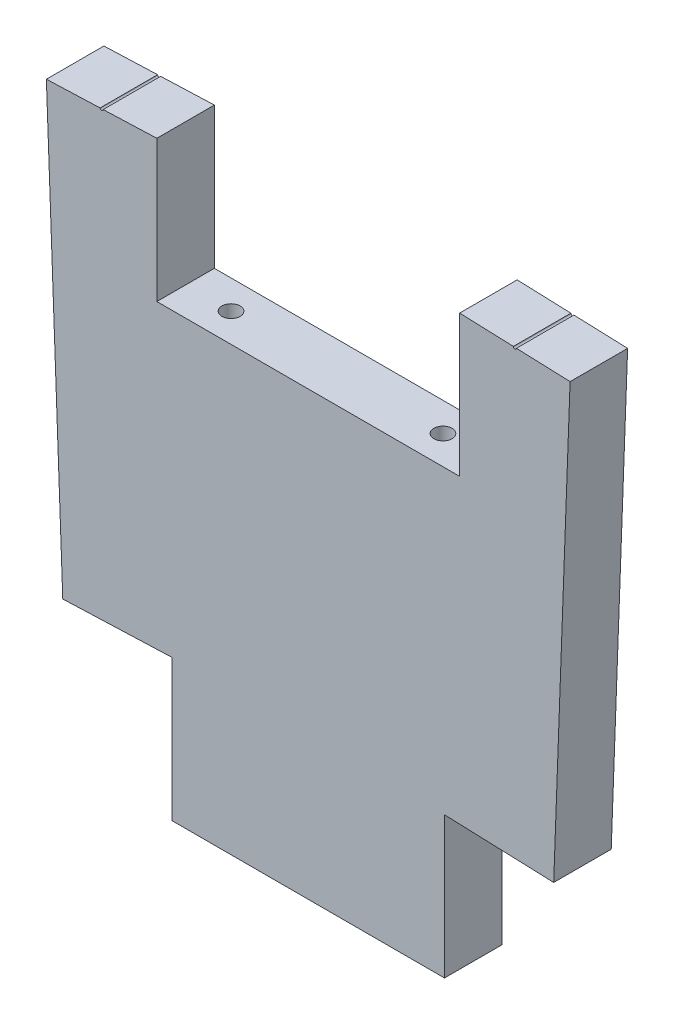
ISO-10303-21;
HEADER;
FILE_DESCRIPTION(('STEP AP214'),'2;1');
FILE_NAME('part.step','',(''),(''),'','','');
FILE_SCHEMA(('AUTOMOTIVE_DESIGN { 1 0 10303 214 1 1 1 1 }'));
ENDSEC;
DATA;
#1=APPLICATION_CONTEXT('core data for automotive mechanical design processes');
#2=APPLICATION_PROTOCOL_DEFINITION('international standard','automotive_design',2000,#1);
#3=PRODUCT_CONTEXT('',#1,'mechanical');
#4=PRODUCT('Part','Part','',(#3));
#5=PRODUCT_RELATED_PRODUCT_CATEGORY('part','',(#4));
#6=PRODUCT_DEFINITION_FORMATION('','',#4);
#7=PRODUCT_DEFINITION_CONTEXT('part definition',#1,'design');
#8=PRODUCT_DEFINITION('design','',#6,#7);
#9=PRODUCT_DEFINITION_SHAPE('','',#8);
#10=(LENGTH_UNIT() NAMED_UNIT(*) SI_UNIT(.MILLI.,.METRE.));
#11=(NAMED_UNIT(*) PLANE_ANGLE_UNIT() SI_UNIT($,.RADIAN.));
#12=(NAMED_UNIT(*) SI_UNIT($,.STERADIAN.) SOLID_ANGLE_UNIT());
#13=UNCERTAINTY_MEASURE_WITH_UNIT(LENGTH_MEASURE(1.E-05),#10,'distance_accuracy_value','');
#14=(GEOMETRIC_REPRESENTATION_CONTEXT(3) GLOBAL_UNCERTAINTY_ASSIGNED_CONTEXT((#13)) GLOBAL_UNIT_ASSIGNED_CONTEXT((#10,
#11,#12)) REPRESENTATION_CONTEXT('',''));
#15=CARTESIAN_POINT('',(0.,0.,0.));
#16=DIRECTION('',(0.,0.,1.));
#17=DIRECTION('',(1.,0.,0.));
#18=AXIS2_PLACEMENT_3D('',#15,#16,#17);
#19=CARTESIAN_POINT('',(50.,34.0019884063979,-19.));
#20=DIRECTION('',(0.0370775576867551,0.999312390954893,0.));
#21=DIRECTION('',(-0.999312390954893,0.0370775576867551,0.));
#22=AXIS2_PLACEMENT_3D('',#19,#20,#21);
#23=PLANE('',#22);
#24=DIRECTION('',(0.,0.,-1.));
#25=VECTOR('',#24,1.);
#26=CARTESIAN_POINT('',(68.7441334339825,33.3065235097577,1.));
#27=LINE('',#26,#25);
#28=CARTESIAN_POINT('',(68.7441334339825,33.3065235097577,0.));
#29=VERTEX_POINT('',#28);
#30=CARTESIAN_POINT('',(68.7441334339825,33.3065235097577,-19.));
#31=VERTEX_POINT('',#30);
#32=EDGE_CURVE('E144',#29,#31,#27,.T.);
#33=ORIENTED_EDGE('',*,*,#32,.F.);
#34=DIRECTION('',(-0.999312390954893,0.0370775576867551,0.));
#35=VECTOR('',#34,1.);
#36=CARTESIAN_POINT('',(50.,34.0019884063979,0.));
#37=LINE('',#36,#35);
#38=CARTESIAN_POINT('',(86.4889544770102,32.6481361708043,0.));
#39=VERTEX_POINT('',#38);
#40=EDGE_CURVE('E197',#39,#29,#37,.T.);
#41=ORIENTED_EDGE('',*,*,#40,.F.);
#42=DIRECTION('',(0.,0.,1.));
#43=VECTOR('',#42,1.);
#44=CARTESIAN_POINT('',(86.4889544770102,32.6481361708043,-19.));
#45=LINE('',#44,#43);
#46=CARTESIAN_POINT('',(86.4889544770102,32.6481361708043,-19.));
#47=VERTEX_POINT('',#46);
#48=EDGE_CURVE('E165',#47,#39,#45,.T.);
#49=ORIENTED_EDGE('',*,*,#48,.F.);
#50=DIRECTION('',(-0.999312390954893,0.0370775576867551,0.));
#51=VECTOR('',#50,1.);
#52=CARTESIAN_POINT('',(50.,34.0019884063979,-19.));
#53=LINE('',#52,#51);
#54=EDGE_CURVE('E159',#47,#31,#53,.T.);
#55=ORIENTED_EDGE('',*,*,#54,.T.);
#56=EDGE_LOOP('',(#33,#41,#49,#55));
#57=FACE_BOUND('',#56,.T.);
#58=ADVANCED_FACE('F34',(#57),#23,.T.);
#59=CARTESIAN_POINT('',(-50.,34.0019884063979,-19.));
#60=DIRECTION('',(-0.0370775576867553,0.999312390954893,0.));
#61=DIRECTION('',(-0.999312390954893,-0.0370775576867553,0.));
#62=AXIS2_PLACEMENT_3D('',#59,#60,#61);
#63=PLANE('',#62);
#64=DIRECTION('',(0.,0.,-1.));
#65=VECTOR('',#64,1.);
#66=CARTESIAN_POINT('',(-67.7448210430277,33.3436010674445,1.));
#67=LINE('',#66,#65);
#68=CARTESIAN_POINT('',(-67.7448210430277,33.3436010674445,0.));
#69=VERTEX_POINT('',#68);
#70=CARTESIAN_POINT('',(-67.7448210430277,33.3436010674445,-19.));
#71=VERTEX_POINT('',#70);
#72=EDGE_CURVE('E213',#69,#71,#67,.T.);
#73=ORIENTED_EDGE('',*,*,#72,.F.);
#74=DIRECTION('',(-0.999312390954893,-0.0370775576867553,0.));
#75=VECTOR('',#74,1.);
#76=CARTESIAN_POINT('',(-50.,34.0019884063979,0.));
#77=LINE('',#76,#75);
#78=CARTESIAN_POINT('',(-50.,34.0019884063979,0.));
#79=VERTEX_POINT('',#78);
#80=EDGE_CURVE('E185',#79,#69,#77,.T.);
#81=ORIENTED_EDGE('',*,*,#80,.F.);
#82=DIRECTION('',(0.,0.,1.));
#83=VECTOR('',#82,1.);
#84=CARTESIAN_POINT('',(-50.,34.0019884063979,-19.));
#85=LINE('',#84,#83);
#86=CARTESIAN_POINT('',(-50.,34.0019884063979,-19.));
#87=VERTEX_POINT('',#86);
#88=EDGE_CURVE('E208',#87,#79,#85,.T.);
#89=ORIENTED_EDGE('',*,*,#88,.F.);
#90=DIRECTION('',(-0.999312390954893,-0.0370775576867553,0.));
#91=VECTOR('',#90,1.);
#92=CARTESIAN_POINT('',(-50.,34.0019884063979,-19.));
#93=LINE('',#92,#91);
#94=EDGE_CURVE('E222',#87,#71,#93,.T.);
#95=ORIENTED_EDGE('',*,*,#94,.T.);
#96=EDGE_LOOP('',(#73,#81,#89,#95));
#97=FACE_BOUND('',#96,.T.);
#98=ADVANCED_FACE('F220',(#97),#63,.T.);
#99=CARTESIAN_POINT('',(50.,-12.7,-19.));
#100=DIRECTION('',(-1.,0.,0.));
#101=DIRECTION('',(0.,0.,1.));
#102=AXIS2_PLACEMENT_3D('',#99,#100,#101);
#103=PLANE('',#102);
#104=DIRECTION('',(0.,-1.,0.));
#105=VECTOR('',#104,1.);
#106=CARTESIAN_POINT('',(50.,-12.7,0.));
#107=LINE('',#106,#105);
#108=CARTESIAN_POINT('',(50.,34.0019884063979,0.));
#109=VERTEX_POINT('',#108);
#110=CARTESIAN_POINT('',(50.,-12.7,0.));
#111=VERTEX_POINT('',#110);
#112=EDGE_CURVE('E174',#109,#111,#107,.T.);
#113=ORIENTED_EDGE('',*,*,#112,.F.);
#114=DIRECTION('',(0.,0.,1.));
#115=VECTOR('',#114,1.);
#116=CARTESIAN_POINT('',(50.,34.0019884063979,-19.));
#117=LINE('',#116,#115);
#118=CARTESIAN_POINT('',(50.,34.0019884063979,-19.));
#119=VERTEX_POINT('',#118);
#120=EDGE_CURVE('E200',#119,#109,#117,.T.);
#121=ORIENTED_EDGE('',*,*,#120,.F.);
#122=DIRECTION('',(0.,-1.,0.));
#123=VECTOR('',#122,1.);
#124=CARTESIAN_POINT('',(50.,-12.7,-19.));
#125=LINE('',#124,#123);
#126=CARTESIAN_POINT('',(50.,-12.7,-19.));
#127=VERTEX_POINT('',#126);
#128=EDGE_CURVE('E199',#119,#127,#125,.T.);
#129=ORIENTED_EDGE('',*,*,#128,.T.);
#130=DIRECTION('',(0.,0.,1.));
#131=VECTOR('',#130,1.);
#132=CARTESIAN_POINT('',(50.,-12.7,-19.));
#133=LINE('',#132,#131);
#134=EDGE_CURVE('E166',#127,#111,#133,.T.);
#135=ORIENTED_EDGE('',*,*,#134,.T.);
#136=EDGE_LOOP('',(#113,#121,#129,#135));
#137=FACE_BOUND('',#136,.T.);
#138=ADVANCED_FACE('F36',(#137),#103,.T.);
#139=DIRECTION('',(0.,0.,-1.));
#140=VECTOR('',#139,1.);
#141=CARTESIAN_POINT('',(67.7448210430277,33.3436010674445,1.));
#142=LINE('',#141,#140);
#143=CARTESIAN_POINT('',(67.7448210430277,33.3436010674445,-19.));
#144=VERTEX_POINT('',#143);
#145=CARTESIAN_POINT('',(67.7448210430277,33.3436010674445,0.));
#146=VERTEX_POINT('',#145);
#147=EDGE_CURVE('E48',#144,#146,#142,.F.);
#148=ORIENTED_EDGE('',*,*,#147,.F.);
#149=EDGE_CURVE('E161',#144,#119,#53,.T.);
#150=ORIENTED_EDGE('',*,*,#149,.T.);
#151=ORIENTED_EDGE('',*,*,#120,.T.);
#152=EDGE_CURVE('E196',#146,#109,#37,.T.);
#153=ORIENTED_EDGE('',*,*,#152,.F.);
#154=EDGE_LOOP('',(#148,#150,#151,#153));
#155=FACE_BOUND('',#154,.T.);
#156=ADVANCED_FACE('F290',(#155),#23,.T.);
#157=CARTESIAN_POINT('',(86.4889544770102,32.6481361708043,-19.));
#158=DIRECTION('',(0.999312390954891,-0.037077557686823,0.));
#159=DIRECTION('',(0.037077557686823,0.999312390954891,0.));
#160=AXIS2_PLACEMENT_3D('',#157,#158,#159);
#161=PLANE('',#160);
#162=DIRECTION('',(0.,0.,1.));
#163=VECTOR('',#162,1.);
#164=CARTESIAN_POINT('',(81.0727891717855,-113.328067188853,-19.));
#165=LINE('',#164,#163);
#166=CARTESIAN_POINT('',(81.0727891717855,-113.328067188853,-19.));
#167=VERTEX_POINT('',#166);
#168=CARTESIAN_POINT('',(81.0727891717855,-113.328067188853,0.));
#169=VERTEX_POINT('',#168);
#170=EDGE_CURVE('E178',#167,#169,#165,.T.);
#171=ORIENTED_EDGE('',*,*,#170,.F.);
#172=DIRECTION('',(0.037077557686823,0.999312390954891,0.));
#173=VECTOR('',#172,1.);
#174=CARTESIAN_POINT('',(86.4889544770102,32.6481361708043,-19.));
#175=LINE('',#174,#173);
#176=EDGE_CURVE('E170',#167,#47,#175,.T.);
#177=ORIENTED_EDGE('',*,*,#176,.T.);
#178=ORIENTED_EDGE('',*,*,#48,.T.);
#179=DIRECTION('',(0.037077557686823,0.999312390954891,0.));
#180=VECTOR('',#179,1.);
#181=CARTESIAN_POINT('',(86.4889544770102,32.6481361708043,0.));
#182=LINE('',#181,#180);
#183=EDGE_CURVE('E194',#169,#39,#182,.T.);
#184=ORIENTED_EDGE('',*,*,#183,.F.);
#185=EDGE_LOOP('',(#171,#177,#178,#184));
#186=FACE_BOUND('',#185,.T.);
#187=ADVANCED_FACE('F251',(#186),#161,.T.);
#188=CARTESIAN_POINT('',(79.3896611879397,-158.691644370145,-19.));
#189=DIRECTION('',(0.,-1.,0.));
#190=DIRECTION('',(0.,0.,-1.));
#191=AXIS2_PLACEMENT_3D('',#188,#189,#190);
#192=PLANE('',#191);
#193=DIRECTION('',(0.,0.,-1.));
#194=VECTOR('',#193,1.);
#195=CARTESIAN_POINT('',(45.,-158.691644370145,0.));
#196=LINE('',#195,#194);
#197=CARTESIAN_POINT('',(45.,-158.691644370145,0.));
#198=VERTEX_POINT('',#197);
#199=CARTESIAN_POINT('',(45.,-158.691644370145,-19.));
#200=VERTEX_POINT('',#199);
#201=EDGE_CURVE('E271',#198,#200,#196,.T.);
#202=ORIENTED_EDGE('',*,*,#201,.F.);
#203=DIRECTION('',(1.,0.,0.));
#204=VECTOR('',#203,1.);
#205=CARTESIAN_POINT('',(79.3896611879397,-158.691644370145,0.));
#206=LINE('',#205,#204);
#207=CARTESIAN_POINT('',(-45.0000000000001,-158.691644370145,0.));
#208=VERTEX_POINT('',#207);
#209=EDGE_CURVE('E191',#208,#198,#206,.T.);
#210=ORIENTED_EDGE('',*,*,#209,.F.);
#211=DIRECTION('',(0.,0.,-1.));
#212=VECTOR('',#211,1.);
#213=CARTESIAN_POINT('',(-45.0000000000001,-158.691644370145,0.));
#214=LINE('',#213,#212);
#215=CARTESIAN_POINT('',(-45.0000000000001,-158.691644370145,-19.));
#216=VERTEX_POINT('',#215);
#217=EDGE_CURVE('E273',#208,#216,#214,.T.);
#218=ORIENTED_EDGE('',*,*,#217,.T.);
#219=DIRECTION('',(1.,0.,0.));
#220=VECTOR('',#219,1.);
#221=CARTESIAN_POINT('',(79.3896611879397,-158.691644370145,-19.));
#222=LINE('',#221,#220);
#223=EDGE_CURVE('E240',#216,#200,#222,.T.);
#224=ORIENTED_EDGE('',*,*,#223,.T.);
#225=EDGE_LOOP('',(#202,#210,#218,#224));
#226=FACE_BOUND('',#225,.T.);
#227=ADVANCED_FACE('F317',(#226),#192,.T.);
#228=CARTESIAN_POINT('',(-86.4889544770102,32.6481361708043,-19.));
#229=DIRECTION('',(-0.999312390954891,-0.037077557686823,0.));
#230=DIRECTION('',(0.037077557686823,-0.999312390954891,0.));
#231=AXIS2_PLACEMENT_3D('',#228,#229,#230);
#232=PLANE('',#231);
#233=DIRECTION('',(0.,0.,-1.));
#234=VECTOR('',#233,1.);
#235=CARTESIAN_POINT('',(-81.0727891717855,-113.32806718885,-19.));
#236=LINE('',#235,#234);
#237=CARTESIAN_POINT('',(-81.0727891717855,-113.32806718885,0.));
#238=VERTEX_POINT('',#237);
#239=CARTESIAN_POINT('',(-81.0727891717855,-113.32806718885,-19.));
#240=VERTEX_POINT('',#239);
#241=EDGE_CURVE('E270',#238,#240,#236,.T.);
#242=ORIENTED_EDGE('',*,*,#241,.F.);
#243=DIRECTION('',(0.037077557686823,-0.999312390954891,0.));
#244=VECTOR('',#243,1.);
#245=CARTESIAN_POINT('',(-86.4889544770102,32.6481361708043,0.));
#246=LINE('',#245,#244);
#247=CARTESIAN_POINT('',(-86.4889544770102,32.6481361708043,0.));
#248=VERTEX_POINT('',#247);
#249=EDGE_CURVE('E188',#248,#238,#246,.T.);
#250=ORIENTED_EDGE('',*,*,#249,.F.);
#251=DIRECTION('',(0.,0.,1.));
#252=VECTOR('',#251,1.);
#253=CARTESIAN_POINT('',(-86.4889544770102,32.6481361708043,-19.));
#254=LINE('',#253,#252);
#255=CARTESIAN_POINT('',(-86.4889544770102,32.6481361708043,-19.));
#256=VERTEX_POINT('',#255);
#257=EDGE_CURVE('E205',#256,#248,#254,.T.);
#258=ORIENTED_EDGE('',*,*,#257,.F.);
#259=DIRECTION('',(0.037077557686823,-0.999312390954891,0.));
#260=VECTOR('',#259,1.);
#261=CARTESIAN_POINT('',(-86.4889544770102,32.6481361708043,-19.));
#262=LINE('',#261,#260);
#263=EDGE_CURVE('E236',#256,#240,#262,.T.);
#264=ORIENTED_EDGE('',*,*,#263,.T.);
#265=EDGE_LOOP('',(#242,#250,#258,#264));
#266=FACE_BOUND('',#265,.T.);
#267=ADVANCED_FACE('F325',(#266),#232,.T.);
#268=DIRECTION('',(0.,0.,-1.));
#269=VECTOR('',#268,1.);
#270=CARTESIAN_POINT('',(-68.7441334339825,33.3065235097577,1.));
#271=LINE('',#270,#269);
#272=CARTESIAN_POINT('',(-68.7441334339825,33.3065235097577,-19.));
#273=VERTEX_POINT('',#272);
#274=CARTESIAN_POINT('',(-68.7441334339825,33.3065235097577,0.));
#275=VERTEX_POINT('',#274);
#276=EDGE_CURVE('E56',#273,#275,#271,.F.);
#277=ORIENTED_EDGE('',*,*,#276,.F.);
#278=EDGE_CURVE('E237',#273,#256,#93,.T.);
#279=ORIENTED_EDGE('',*,*,#278,.T.);
#280=ORIENTED_EDGE('',*,*,#257,.T.);
#281=EDGE_CURVE('E184',#275,#248,#77,.T.);
#282=ORIENTED_EDGE('',*,*,#281,.F.);
#283=EDGE_LOOP('',(#277,#279,#280,#282));
#284=FACE_BOUND('',#283,.T.);
#285=ADVANCED_FACE('F328',(#284),#63,.T.);
#286=CARTESIAN_POINT('',(-50.,-12.7,-19.));
#287=DIRECTION('',(1.,0.,0.));
#288=DIRECTION('',(0.,0.,-1.));
#289=AXIS2_PLACEMENT_3D('',#286,#287,#288);
#290=PLANE('',#289);
#291=DIRECTION('',(0.,1.,0.));
#292=VECTOR('',#291,1.);
#293=CARTESIAN_POINT('',(-50.,-12.7,0.));
#294=LINE('',#293,#292);
#295=CARTESIAN_POINT('',(-50.,-12.7,0.));
#296=VERTEX_POINT('',#295);
#297=EDGE_CURVE('E181',#296,#79,#294,.T.);
#298=ORIENTED_EDGE('',*,*,#297,.F.);
#299=DIRECTION('',(0.,0.,1.));
#300=VECTOR('',#299,1.);
#301=CARTESIAN_POINT('',(-50.,-12.7,-19.));
#302=LINE('',#301,#300);
#303=CARTESIAN_POINT('',(-50.,-12.7,-19.));
#304=VERTEX_POINT('',#303);
#305=EDGE_CURVE('E168',#304,#296,#302,.T.);
#306=ORIENTED_EDGE('',*,*,#305,.F.);
#307=DIRECTION('',(0.,1.,0.));
#308=VECTOR('',#307,1.);
#309=CARTESIAN_POINT('',(-50.,-12.7,-19.));
#310=LINE('',#309,#308);
#311=EDGE_CURVE('E232',#304,#87,#310,.T.);
#312=ORIENTED_EDGE('',*,*,#311,.T.);
#313=ORIENTED_EDGE('',*,*,#88,.T.);
#314=EDGE_LOOP('',(#298,#306,#312,#313));
#315=FACE_BOUND('',#314,.T.);
#316=ADVANCED_FACE('F229',(#315),#290,.T.);
#317=CARTESIAN_POINT('',(-50.,-12.7,-19.));
#318=DIRECTION('',(0.,1.,0.));
#319=DIRECTION('',(0.,0.,1.));
#320=AXIS2_PLACEMENT_3D('',#317,#318,#319);
#321=PLANE('',#320);
#322=CARTESIAN_POINT('',(-35.0000000000022,-12.7,-9.5000000000004));
#323=DIRECTION('',(0.,1.,0.));
#324=DIRECTION('',(0.,0.,1.));
#325=AXIS2_PLACEMENT_3D('',#322,#323,#324);
#326=CIRCLE('',#325,3.);
#327=CARTESIAN_POINT('',(-35.0000000000022,-12.7,-6.5000000000004));
#328=VERTEX_POINT('',#327);
#329=EDGE_CURVE('E223',#328,#328,#326,.T.);
#330=ORIENTED_EDGE('',*,*,#329,.F.);
#331=EDGE_LOOP('',(#330));
#332=FACE_BOUND('',#331,.T.);
#333=CARTESIAN_POINT('',(34.9999999999978,-12.7,-9.5000000000004));
#334=DIRECTION('',(0.,1.,0.));
#335=DIRECTION('',(0.,0.,1.));
#336=AXIS2_PLACEMENT_3D('',#333,#334,#335);
#337=CIRCLE('',#336,3.);
#338=CARTESIAN_POINT('',(34.9999999999978,-12.7,-6.5000000000004));
#339=VERTEX_POINT('',#338);
#340=EDGE_CURVE('E298',#339,#339,#337,.T.);
#341=ORIENTED_EDGE('',*,*,#340,.F.);
#342=EDGE_LOOP('',(#341));
#343=FACE_BOUND('',#342,.T.);
#344=DIRECTION('',(-1.,0.,0.));
#345=VECTOR('',#344,1.);
#346=CARTESIAN_POINT('',(-50.,-12.7,0.));
#347=LINE('',#346,#345);
#348=EDGE_CURVE('E177',#111,#296,#347,.T.);
#349=ORIENTED_EDGE('',*,*,#348,.F.);
#350=ORIENTED_EDGE('',*,*,#134,.F.);
#351=DIRECTION('',(-1.,0.,0.));
#352=VECTOR('',#351,1.);
#353=CARTESIAN_POINT('',(-50.,-12.7,-19.));
#354=LINE('',#353,#352);
#355=EDGE_CURVE('E282',#127,#304,#354,.T.);
#356=ORIENTED_EDGE('',*,*,#355,.T.);
#357=ORIENTED_EDGE('',*,*,#305,.T.);
#358=EDGE_LOOP('',(#349,#350,#356,#357));
#359=FACE_BOUND('',#358,.T.);
#360=ADVANCED_FACE('F284',(#332,#343,#359),#321,.T.);
#361=CARTESIAN_POINT('',(50.,-158.691644370145,-19.));
#362=DIRECTION('',(0.,0.,1.));
#363=DIRECTION('',(1.,0.,0.));
#364=AXIS2_PLACEMENT_3D('',#361,#362,#363);
#365=PLANE('',#364);
#366=ORIENTED_EDGE('',*,*,#149,.F.);
#367=CARTESIAN_POINT('',(68.2444772385051,33.3250622886011,-19.));
#368=DIRECTION('',(0.,0.,-1.));
#369=DIRECTION('',(1.,0.,0.));
#370=AXIS2_PLACEMENT_3D('',#367,#368,#369);
#371=CIRCLE('',#370,0.499999999999999);
#372=EDGE_CURVE('E147',#31,#144,#371,.T.);
#373=ORIENTED_EDGE('',*,*,#372,.F.);
#374=ORIENTED_EDGE('',*,*,#54,.F.);
#375=ORIENTED_EDGE('',*,*,#176,.F.);
#376=DIRECTION('',(0.999312390954891,-0.0370775576868232,0.));
#377=VECTOR('',#376,1.);
#378=CARTESIAN_POINT('',(45.,-111.989655963747,-19.));
#379=LINE('',#378,#377);
#380=CARTESIAN_POINT('',(45.,-111.989655963747,-19.));
#381=VERTEX_POINT('',#380);
#382=EDGE_CURVE('E255',#381,#167,#379,.T.);
#383=ORIENTED_EDGE('',*,*,#382,.F.);
#384=DIRECTION('',(0.,1.,0.));
#385=VECTOR('',#384,1.);
#386=CARTESIAN_POINT('',(45.,-158.691644370145,-19.));
#387=LINE('',#386,#385);
#388=EDGE_CURVE('E257',#200,#381,#387,.T.);
#389=ORIENTED_EDGE('',*,*,#388,.F.);
#390=ORIENTED_EDGE('',*,*,#223,.F.);
#391=DIRECTION('',(0.,-1.,0.));
#392=VECTOR('',#391,1.);
#393=CARTESIAN_POINT('',(-45.,-111.989655963747,-19.));
#394=LINE('',#393,#392);
#395=CARTESIAN_POINT('',(-45.,-111.989655963747,-19.));
#396=VERTEX_POINT('',#395);
#397=EDGE_CURVE('E264',#396,#216,#394,.T.);
#398=ORIENTED_EDGE('',*,*,#397,.F.);
#399=DIRECTION('',(0.999312390954893,0.037077557686755,0.));
#400=VECTOR('',#399,1.);
#401=CARTESIAN_POINT('',(-176.999986596092,-116.887260718743,-19.));
#402=LINE('',#401,#400);
#403=EDGE_CURVE('E304',#240,#396,#402,.T.);
#404=ORIENTED_EDGE('',*,*,#403,.F.);
#405=ORIENTED_EDGE('',*,*,#263,.F.);
#406=ORIENTED_EDGE('',*,*,#278,.F.);
#407=CARTESIAN_POINT('',(-68.2444772385051,33.3250622886011,-19.));
#408=DIRECTION('',(0.,0.,-1.));
#409=DIRECTION('',(-1.,0.,0.));
#410=AXIS2_PLACEMENT_3D('',#407,#408,#409);
#411=CIRCLE('',#410,0.499999999999999);
#412=EDGE_CURVE('E152',#71,#273,#411,.T.);
#413=ORIENTED_EDGE('',*,*,#412,.F.);
#414=ORIENTED_EDGE('',*,*,#94,.F.);
#415=ORIENTED_EDGE('',*,*,#311,.F.);
#416=ORIENTED_EDGE('',*,*,#355,.F.);
#417=ORIENTED_EDGE('',*,*,#128,.F.);
#418=EDGE_LOOP('',(#366,#373,#374,#375,#383,#389,#390,#398,#404,#405,#406,#413,#414,#415,#416,#417));
#419=FACE_BOUND('',#418,.T.);
#420=ADVANCED_FACE('F157',(#419),#365,.F.);
#421=CARTESIAN_POINT('',(50.,-158.691644370145,0.));
#422=DIRECTION('',(0.,0.,1.));
#423=DIRECTION('',(1.,0.,0.));
#424=AXIS2_PLACEMENT_3D('',#421,#422,#423);
#425=PLANE('',#424);
#426=CARTESIAN_POINT('',(68.2444772385051,33.3250622886011,0.));
#427=DIRECTION('',(0.,0.,1.));
#428=DIRECTION('',(1.,0.,0.));
#429=AXIS2_PLACEMENT_3D('',#426,#427,#428);
#430=CIRCLE('',#429,0.499999999999999);
#431=EDGE_CURVE('E11',#146,#29,#430,.T.);
#432=ORIENTED_EDGE('',*,*,#431,.F.);
#433=ORIENTED_EDGE('',*,*,#152,.T.);
#434=ORIENTED_EDGE('',*,*,#112,.T.);
#435=ORIENTED_EDGE('',*,*,#348,.T.);
#436=ORIENTED_EDGE('',*,*,#297,.T.);
#437=ORIENTED_EDGE('',*,*,#80,.T.);
#438=CARTESIAN_POINT('',(-68.2444772385051,33.3250622886011,0.));
#439=DIRECTION('',(0.,0.,1.));
#440=DIRECTION('',(1.,0.,0.));
#441=AXIS2_PLACEMENT_3D('',#438,#439,#440);
#442=CIRCLE('',#441,0.499999999999999);
#443=EDGE_CURVE('E42',#275,#69,#442,.T.);
#444=ORIENTED_EDGE('',*,*,#443,.F.);
#445=ORIENTED_EDGE('',*,*,#281,.T.);
#446=ORIENTED_EDGE('',*,*,#249,.T.);
#447=DIRECTION('',(-0.999312390954893,-0.0370775576867551,0.));
#448=VECTOR('',#447,1.);
#449=CARTESIAN_POINT('',(48.1389941896389,-108.533913333904,0.));
#450=LINE('',#449,#448);
#451=CARTESIAN_POINT('',(-45.,-111.989655963747,0.));
#452=VERTEX_POINT('',#451);
#453=EDGE_CURVE('E203',#452,#238,#450,.T.);
#454=ORIENTED_EDGE('',*,*,#453,.F.);
#455=DIRECTION('',(0.,-1.,0.));
#456=VECTOR('',#455,1.);
#457=CARTESIAN_POINT('',(-45.,-111.989655963747,0.));
#458=LINE('',#457,#456);
#459=EDGE_CURVE('E259',#452,#208,#458,.T.);
#460=ORIENTED_EDGE('',*,*,#459,.T.);
#461=ORIENTED_EDGE('',*,*,#209,.T.);
#462=DIRECTION('',(0.,1.,0.));
#463=VECTOR('',#462,1.);
#464=CARTESIAN_POINT('',(45.,-158.691644370145,0.));
#465=LINE('',#464,#463);
#466=CARTESIAN_POINT('',(45.,-111.989655963747,0.));
#467=VERTEX_POINT('',#466);
#468=EDGE_CURVE('E262',#198,#467,#465,.T.);
#469=ORIENTED_EDGE('',*,*,#468,.T.);
#470=DIRECTION('',(0.999312390954891,-0.0370775576868232,0.));
#471=VECTOR('',#470,1.);
#472=CARTESIAN_POINT('',(45.,-111.989655963747,0.));
#473=LINE('',#472,#471);
#474=EDGE_CURVE('E278',#467,#169,#473,.T.);
#475=ORIENTED_EDGE('',*,*,#474,.T.);
#476=ORIENTED_EDGE('',*,*,#183,.T.);
#477=ORIENTED_EDGE('',*,*,#40,.T.);
#478=EDGE_LOOP('',(#432,#433,#434,#435,#436,#437,#444,#445,#446,#454,#460,#461,#469,#475,#476,#477));
#479=FACE_BOUND('',#478,.T.);
#480=ADVANCED_FACE('F225',(#479),#425,.T.);
#481=CARTESIAN_POINT('',(-176.999986596092,-116.887260718743,0.));
#482=DIRECTION('',(-0.0370775576867551,0.999312390954893,0.));
#483=DIRECTION('',(-0.999312390954893,-0.0370775576867551,0.));
#484=AXIS2_PLACEMENT_3D('',#481,#482,#483);
#485=PLANE('',#484);
#486=ORIENTED_EDGE('',*,*,#241,.T.);
#487=ORIENTED_EDGE('',*,*,#403,.T.);
#488=DIRECTION('',(0.,0.,-1.));
#489=VECTOR('',#488,1.);
#490=CARTESIAN_POINT('',(-45.,-111.989655963747,0.));
#491=LINE('',#490,#489);
#492=EDGE_CURVE('E275',#452,#396,#491,.T.);
#493=ORIENTED_EDGE('',*,*,#492,.F.);
#494=ORIENTED_EDGE('',*,*,#453,.T.);
#495=EDGE_LOOP('',(#486,#487,#493,#494));
#496=FACE_BOUND('',#495,.T.);
#497=ADVANCED_FACE('F320',(#496),#485,.F.);
#498=CARTESIAN_POINT('',(-45.,-111.989655963747,0.));
#499=DIRECTION('',(1.,0.,0.));
#500=DIRECTION('',(0.,1.,0.));
#501=AXIS2_PLACEMENT_3D('',#498,#499,#500);
#502=PLANE('',#501);
#503=ORIENTED_EDGE('',*,*,#397,.T.);
#504=ORIENTED_EDGE('',*,*,#217,.F.);
#505=ORIENTED_EDGE('',*,*,#459,.F.);
#506=ORIENTED_EDGE('',*,*,#492,.T.);
#507=EDGE_LOOP('',(#503,#504,#505,#506));
#508=FACE_BOUND('',#507,.T.);
#509=ADVANCED_FACE('F313',(#508),#502,.F.);
#510=CARTESIAN_POINT('',(45.,-111.989655963747,0.));
#511=DIRECTION('',(0.0370775576868232,0.999312390954891,0.));
#512=DIRECTION('',(-0.999312390954891,0.0370775576868232,0.));
#513=AXIS2_PLACEMENT_3D('',#510,#511,#512);
#514=PLANE('',#513);
#515=ORIENTED_EDGE('',*,*,#170,.T.);
#516=ORIENTED_EDGE('',*,*,#474,.F.);
#517=DIRECTION('',(0.,0.,-1.));
#518=VECTOR('',#517,1.);
#519=CARTESIAN_POINT('',(45.,-111.989655963747,0.));
#520=LINE('',#519,#518);
#521=EDGE_CURVE('E268',#467,#381,#520,.T.);
#522=ORIENTED_EDGE('',*,*,#521,.T.);
#523=ORIENTED_EDGE('',*,*,#382,.T.);
#524=EDGE_LOOP('',(#515,#516,#522,#523));
#525=FACE_BOUND('',#524,.T.);
#526=ADVANCED_FACE('F428',(#525),#514,.F.);
#527=CARTESIAN_POINT('',(45.,-158.691644370145,0.));
#528=DIRECTION('',(-1.,0.,0.));
#529=DIRECTION('',(0.,-1.,0.));
#530=AXIS2_PLACEMENT_3D('',#527,#528,#529);
#531=PLANE('',#530);
#532=ORIENTED_EDGE('',*,*,#388,.T.);
#533=ORIENTED_EDGE('',*,*,#521,.F.);
#534=ORIENTED_EDGE('',*,*,#468,.F.);
#535=ORIENTED_EDGE('',*,*,#201,.T.);
#536=EDGE_LOOP('',(#532,#533,#534,#535));
#537=FACE_BOUND('',#536,.T.);
#538=ADVANCED_FACE('F426',(#537),#531,.F.);
#539=CARTESIAN_POINT('',(34.9999999999978,-22.7,-9.5000000000004));
#540=DIRECTION('',(0.,1.,0.));
#541=DIRECTION('',(0.,0.,1.));
#542=AXIS2_PLACEMENT_3D('',#539,#540,#541);
#543=CYLINDRICAL_SURFACE('',#542,3.);
#544=CARTESIAN_POINT('',(34.9999999999978,-22.7,-9.5000000000004));
#545=DIRECTION('',(0.,1.,0.));
#546=DIRECTION('',(0.,0.,1.));
#547=AXIS2_PLACEMENT_3D('',#544,#545,#546);
#548=CIRCLE('',#547,3.);
#549=CARTESIAN_POINT('',(34.9999999999978,-22.7,-6.5000000000004));
#550=VERTEX_POINT('',#549);
#551=EDGE_CURVE('E301',#550,#550,#548,.T.);
#552=ORIENTED_EDGE('',*,*,#551,.F.);
#553=EDGE_LOOP('',(#552));
#554=FACE_BOUND('',#553,.T.);
#555=ORIENTED_EDGE('',*,*,#340,.T.);
#556=EDGE_LOOP('',(#555));
#557=FACE_BOUND('',#556,.T.);
#558=ADVANCED_FACE('F422',(#554,#557),#543,.F.);
#559=CARTESIAN_POINT('',(34.9999999999978,-22.7,-9.5000000000004));
#560=DIRECTION('',(0.,1.,0.));
#561=DIRECTION('',(0.,0.,1.));
#562=AXIS2_PLACEMENT_3D('',#559,#560,#561);
#563=PLANE('',#562);
#564=ORIENTED_EDGE('',*,*,#551,.T.);
#565=EDGE_LOOP('',(#564));
#566=FACE_BOUND('',#565,.T.);
#567=ADVANCED_FACE('F418',(#566),#563,.T.);
#568=CARTESIAN_POINT('',(-35.0000000000022,-22.7,-9.5000000000004));
#569=DIRECTION('',(0.,1.,0.));
#570=DIRECTION('',(0.,0.,1.));
#571=AXIS2_PLACEMENT_3D('',#568,#569,#570);
#572=CYLINDRICAL_SURFACE('',#571,3.);
#573=CARTESIAN_POINT('',(-35.0000000000022,-22.7,-9.5000000000004));
#574=DIRECTION('',(0.,1.,0.));
#575=DIRECTION('',(0.,0.,1.));
#576=AXIS2_PLACEMENT_3D('',#573,#574,#575);
#577=CIRCLE('',#576,3.);
#578=CARTESIAN_POINT('',(-35.0000000000022,-22.7,-6.5000000000004));
#579=VERTEX_POINT('',#578);
#580=EDGE_CURVE('E295',#579,#579,#577,.T.);
#581=ORIENTED_EDGE('',*,*,#580,.F.);
#582=EDGE_LOOP('',(#581));
#583=FACE_BOUND('',#582,.T.);
#584=ORIENTED_EDGE('',*,*,#329,.T.);
#585=EDGE_LOOP('',(#584));
#586=FACE_BOUND('',#585,.T.);
#587=ADVANCED_FACE('F414',(#583,#586),#572,.F.);
#588=CARTESIAN_POINT('',(-35.0000000000022,-22.7,-9.5000000000004));
#589=DIRECTION('',(0.,1.,0.));
#590=DIRECTION('',(0.,0.,1.));
#591=AXIS2_PLACEMENT_3D('',#588,#589,#590);
#592=PLANE('',#591);
#593=ORIENTED_EDGE('',*,*,#580,.T.);
#594=EDGE_LOOP('',(#593));
#595=FACE_BOUND('',#594,.T.);
#596=ADVANCED_FACE('F399',(#595),#592,.T.);
#597=CARTESIAN_POINT('',(-68.2444772385051,33.3250622886011,1.));
#598=DIRECTION('',(0.,0.,-1.));
#599=DIRECTION('',(-1.,0.,0.));
#600=AXIS2_PLACEMENT_3D('',#597,#598,#599);
#601=CYLINDRICAL_SURFACE('',#600,0.499999999999999);
#602=ORIENTED_EDGE('',*,*,#72,.T.);
#603=ORIENTED_EDGE('',*,*,#412,.T.);
#604=ORIENTED_EDGE('',*,*,#276,.T.);
#605=ORIENTED_EDGE('',*,*,#443,.T.);
#606=EDGE_LOOP('',(#602,#603,#604,#605));
#607=FACE_BOUND('',#606,.T.);
#608=ADVANCED_FACE('F212',(#607),#601,.F.);
#609=CARTESIAN_POINT('',(68.2444772385051,33.3250622886011,1.));
#610=DIRECTION('',(0.,0.,-1.));
#611=DIRECTION('',(-1.,0.,0.));
#612=AXIS2_PLACEMENT_3D('',#609,#610,#611);
#613=CYLINDRICAL_SURFACE('',#612,0.499999999999999);
#614=ORIENTED_EDGE('',*,*,#32,.T.);
#615=ORIENTED_EDGE('',*,*,#372,.T.);
#616=ORIENTED_EDGE('',*,*,#147,.T.);
#617=ORIENTED_EDGE('',*,*,#431,.T.);
#618=EDGE_LOOP('',(#614,#615,#616,#617));
#619=FACE_BOUND('',#618,.T.);
#620=ADVANCED_FACE('F146',(#619),#613,.F.);
#621=CLOSED_SHELL('',(#58,#98,#138,#156,#187,#227,#267,#285,#316,#360,#420,#480,#497,#509,#526,
#538,#558,#567,#587,#596,#608,#620));
#622=MANIFOLD_SOLID_BREP('B2',#621);
#623=ADVANCED_BREP_SHAPE_REPRESENTATION('',(#18,#622),#14);
#624=SHAPE_DEFINITION_REPRESENTATION(#9,#623);
ENDSEC;
END-ISO-10303-21;
